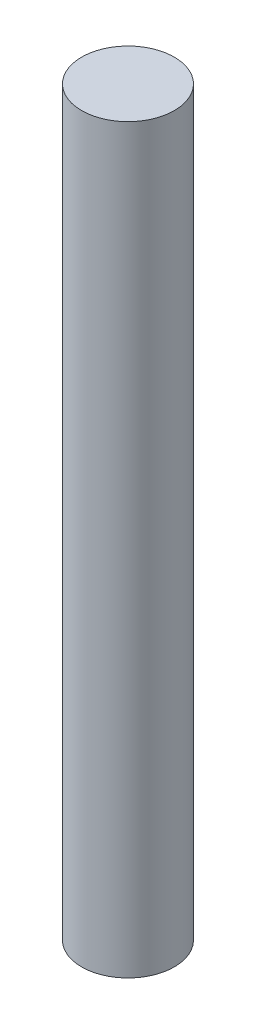
ISO-10303-21;
HEADER;
FILE_DESCRIPTION(('STEP AP214'),'2;1');
FILE_NAME('part.step','',(''),(''),'','','');
FILE_SCHEMA(('AUTOMOTIVE_DESIGN { 1 0 10303 214 1 1 1 1 }'));
ENDSEC;
DATA;
#1=APPLICATION_CONTEXT('core data for automotive mechanical design processes');
#2=APPLICATION_PROTOCOL_DEFINITION('international standard','automotive_design',2000,#1);
#3=PRODUCT_CONTEXT('',#1,'mechanical');
#4=PRODUCT('Part','Part','',(#3));
#5=PRODUCT_RELATED_PRODUCT_CATEGORY('part','',(#4));
#6=PRODUCT_DEFINITION_FORMATION('','',#4);
#7=PRODUCT_DEFINITION_CONTEXT('part definition',#1,'design');
#8=PRODUCT_DEFINITION('design','',#6,#7);
#9=PRODUCT_DEFINITION_SHAPE('','',#8);
#10=(LENGTH_UNIT() NAMED_UNIT(*) SI_UNIT(.MILLI.,.METRE.));
#11=(NAMED_UNIT(*) PLANE_ANGLE_UNIT() SI_UNIT($,.RADIAN.));
#12=(NAMED_UNIT(*) SI_UNIT($,.STERADIAN.) SOLID_ANGLE_UNIT());
#13=UNCERTAINTY_MEASURE_WITH_UNIT(LENGTH_MEASURE(1.E-05),#10,'distance_accuracy_value','');
#14=(GEOMETRIC_REPRESENTATION_CONTEXT(3) GLOBAL_UNCERTAINTY_ASSIGNED_CONTEXT((#13)) GLOBAL_UNIT_ASSIGNED_CONTEXT((#10,
#11,#12)) REPRESENTATION_CONTEXT('',''));
#15=CARTESIAN_POINT('',(0.,0.,0.));
#16=DIRECTION('',(0.,0.,1.));
#17=DIRECTION('',(1.,0.,0.));
#18=AXIS2_PLACEMENT_3D('',#15,#16,#17);
#19=CARTESIAN_POINT('',(0.,200.,0.));
#20=DIRECTION('',(0.,-1.,0.));
#21=DIRECTION('',(0.,0.,-1.));
#22=AXIS2_PLACEMENT_3D('',#19,#20,#21);
#23=CYLINDRICAL_SURFACE('',#22,12.5);
#24=CARTESIAN_POINT('',(0.,200.,0.));
#25=DIRECTION('',(0.,1.,0.));
#26=DIRECTION('',(0.,0.,1.));
#27=AXIS2_PLACEMENT_3D('',#24,#25,#26);
#28=CIRCLE('',#27,12.5);
#29=CARTESIAN_POINT('',(0.,200.,12.5));
#30=VERTEX_POINT('',#29);
#31=EDGE_CURVE('E10',#30,#30,#28,.T.);
#32=ORIENTED_EDGE('',*,*,#31,.F.);
#33=EDGE_LOOP('',(#32));
#34=FACE_BOUND('',#33,.T.);
#35=CARTESIAN_POINT('',(0.,0.,0.));
#36=DIRECTION('',(0.,1.,0.));
#37=DIRECTION('',(0.,0.,1.));
#38=AXIS2_PLACEMENT_3D('',#35,#36,#37);
#39=CIRCLE('',#38,12.5);
#40=CARTESIAN_POINT('',(0.,0.,12.5));
#41=VERTEX_POINT('',#40);
#42=EDGE_CURVE('E44',#41,#41,#39,.T.);
#43=ORIENTED_EDGE('',*,*,#42,.T.);
#44=EDGE_LOOP('',(#43));
#45=FACE_BOUND('',#44,.T.);
#46=ADVANCED_FACE('F41',(#34,#45),#23,.T.);
#47=CARTESIAN_POINT('',(0.,200.,0.));
#48=DIRECTION('',(0.,1.,0.));
#49=DIRECTION('',(0.,0.,1.));
#50=AXIS2_PLACEMENT_3D('',#47,#48,#49);
#51=PLANE('',#50);
#52=ORIENTED_EDGE('',*,*,#31,.T.);
#53=EDGE_LOOP('',(#52));
#54=FACE_BOUND('',#53,.T.);
#55=ADVANCED_FACE('F58',(#54),#51,.T.);
#56=CARTESIAN_POINT('',(0.,0.,0.));
#57=DIRECTION('',(0.,1.,0.));
#58=DIRECTION('',(0.,0.,1.));
#59=AXIS2_PLACEMENT_3D('',#56,#57,#58);
#60=PLANE('',#59);
#61=ORIENTED_EDGE('',*,*,#42,.F.);
#62=EDGE_LOOP('',(#61));
#63=FACE_BOUND('',#62,.T.);
#64=ADVANCED_FACE('F56',(#63),#60,.F.);
#65=CLOSED_SHELL('',(#46,#55,#64));
#66=MANIFOLD_SOLID_BREP('B2',#65);
#67=ADVANCED_BREP_SHAPE_REPRESENTATION('',(#18,#66),#14);
#68=SHAPE_DEFINITION_REPRESENTATION(#9,#67);
ENDSEC;
END-ISO-10303-21;
